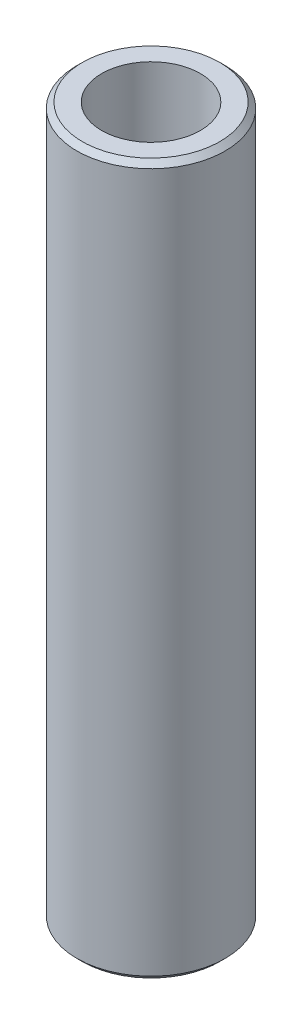
ISO-10303-21;
HEADER;
FILE_DESCRIPTION(('STEP AP214'),'2;1');
FILE_NAME('part.step','',(''),(''),'','','');
FILE_SCHEMA(('AUTOMOTIVE_DESIGN { 1 0 10303 214 1 1 1 1 }'));
ENDSEC;
DATA;
#1=APPLICATION_CONTEXT('core data for automotive mechanical design processes');
#2=APPLICATION_PROTOCOL_DEFINITION('international standard','automotive_design',2000,#1);
#3=PRODUCT_CONTEXT('',#1,'mechanical');
#4=PRODUCT('Part','Part','',(#3));
#5=PRODUCT_RELATED_PRODUCT_CATEGORY('part','',(#4));
#6=PRODUCT_DEFINITION_FORMATION('','',#4);
#7=PRODUCT_DEFINITION_CONTEXT('part definition',#1,'design');
#8=PRODUCT_DEFINITION('design','',#6,#7);
#9=PRODUCT_DEFINITION_SHAPE('','',#8);
#10=(LENGTH_UNIT() NAMED_UNIT(*) SI_UNIT(.MILLI.,.METRE.));
#11=(NAMED_UNIT(*) PLANE_ANGLE_UNIT() SI_UNIT($,.RADIAN.));
#12=(NAMED_UNIT(*) SI_UNIT($,.STERADIAN.) SOLID_ANGLE_UNIT());
#13=UNCERTAINTY_MEASURE_WITH_UNIT(LENGTH_MEASURE(1.E-05),#10,'distance_accuracy_value','');
#14=(GEOMETRIC_REPRESENTATION_CONTEXT(3) GLOBAL_UNCERTAINTY_ASSIGNED_CONTEXT((#13)) GLOBAL_UNIT_ASSIGNED_CONTEXT((#10,
#11,#12)) REPRESENTATION_CONTEXT('',''));
#15=CARTESIAN_POINT('',(0.,0.,0.));
#16=DIRECTION('',(0.,0.,1.));
#17=DIRECTION('',(1.,0.,0.));
#18=AXIS2_PLACEMENT_3D('',#15,#16,#17);
#19=CARTESIAN_POINT('',(0.,383.320295647991,0.));
#20=DIRECTION('',(0.,-1.,0.));
#21=DIRECTION('',(0.,0.,-1.));
#22=AXIS2_PLACEMENT_3D('',#19,#20,#21);
#23=CYLINDRICAL_SURFACE('',#22,40.);
#24=CARTESIAN_POINT('',(0.,380.403061199451,0.));
#25=DIRECTION('',(0.,1.,0.));
#26=DIRECTION('',(0.,0.,1.));
#27=AXIS2_PLACEMENT_3D('',#24,#25,#26);
#28=CIRCLE('',#27,40.);
#29=CARTESIAN_POINT('',(0.,380.403061199451,-40.));
#30=VERTEX_POINT('',#29);
#31=EDGE_CURVE('E50',#30,#30,#28,.F.);
#32=ORIENTED_EDGE('',*,*,#31,.T.);
#33=EDGE_LOOP('',(#32));
#34=FACE_BOUND('',#33,.T.);
#35=CARTESIAN_POINT('',(0.,2.9172344485402,0.));
#36=DIRECTION('',(0.,1.,0.));
#37=DIRECTION('',(0.,0.,1.));
#38=AXIS2_PLACEMENT_3D('',#35,#36,#37);
#39=CIRCLE('',#38,40.);
#40=CARTESIAN_POINT('',(0.,2.9172344485402,40.));
#41=VERTEX_POINT('',#40);
#42=EDGE_CURVE('E51',#41,#41,#39,.T.);
#43=ORIENTED_EDGE('',*,*,#42,.T.);
#44=EDGE_LOOP('',(#43));
#45=FACE_BOUND('',#44,.T.);
#46=ADVANCED_FACE('F39',(#34,#45),#23,.T.);
#47=CARTESIAN_POINT('',(0.,383.320295647991,0.));
#48=DIRECTION('',(0.,1.,0.));
#49=DIRECTION('',(0.,0.,1.));
#50=AXIS2_PLACEMENT_3D('',#47,#48,#49);
#51=PLANE('',#50);
#52=CARTESIAN_POINT('',(0.,383.320295647991,0.));
#53=DIRECTION('',(0.,1.,0.));
#54=DIRECTION('',(0.,0.,1.));
#55=AXIS2_PLACEMENT_3D('',#52,#53,#54);
#56=CIRCLE('',#55,37.0827655514597);
#57=CARTESIAN_POINT('',(0.,383.320295647991,-37.0827655514597));
#58=VERTEX_POINT('',#57);
#59=EDGE_CURVE('E54',#58,#58,#56,.T.);
#60=ORIENTED_EDGE('',*,*,#59,.T.);
#61=EDGE_LOOP('',(#60));
#62=FACE_BOUND('',#61,.T.);
#63=CARTESIAN_POINT('',(0.,383.320295647991,0.));
#64=DIRECTION('',(0.,1.,0.));
#65=DIRECTION('',(0.,0.,1.));
#66=AXIS2_PLACEMENT_3D('',#63,#64,#65);
#67=CIRCLE('',#66,26.6566328088334);
#68=CARTESIAN_POINT('',(0.,383.320295647991,26.6566328088334));
#69=VERTEX_POINT('',#68);
#70=EDGE_CURVE('E58',#69,#69,#67,.T.);
#71=ORIENTED_EDGE('',*,*,#70,.F.);
#72=EDGE_LOOP('',(#71));
#73=FACE_BOUND('',#72,.T.);
#74=ADVANCED_FACE('F69',(#62,#73),#51,.T.);
#75=CARTESIAN_POINT('',(0.,0.,0.));
#76=DIRECTION('',(0.,1.,0.));
#77=DIRECTION('',(0.,0.,1.));
#78=AXIS2_PLACEMENT_3D('',#75,#76,#77);
#79=PLANE('',#78);
#80=CARTESIAN_POINT('',(0.,0.,0.));
#81=DIRECTION('',(0.,1.,0.));
#82=DIRECTION('',(0.,0.,1.));
#83=AXIS2_PLACEMENT_3D('',#80,#81,#82);
#84=CIRCLE('',#83,37.0827655514598);
#85=CARTESIAN_POINT('',(0.,0.,37.0827655514598));
#86=VERTEX_POINT('',#85);
#87=EDGE_CURVE('E10',#86,#86,#84,.F.);
#88=ORIENTED_EDGE('',*,*,#87,.T.);
#89=EDGE_LOOP('',(#88));
#90=FACE_BOUND('',#89,.T.);
#91=CARTESIAN_POINT('',(0.,0.,0.));
#92=DIRECTION('',(0.,1.,0.));
#93=DIRECTION('',(0.,0.,1.));
#94=AXIS2_PLACEMENT_3D('',#91,#92,#93);
#95=CIRCLE('',#94,26.6566328088334);
#96=CARTESIAN_POINT('',(0.,0.,26.6566328088334));
#97=VERTEX_POINT('',#96);
#98=EDGE_CURVE('E63',#97,#97,#95,.T.);
#99=ORIENTED_EDGE('',*,*,#98,.T.);
#100=EDGE_LOOP('',(#99));
#101=FACE_BOUND('',#100,.T.);
#102=ADVANCED_FACE('F75',(#90,#101),#79,.F.);
#103=CARTESIAN_POINT('',(0.,383.320295647991,0.));
#104=DIRECTION('',(0.,-1.,0.));
#105=DIRECTION('',(0.,0.,-1.));
#106=AXIS2_PLACEMENT_3D('',#103,#104,#105);
#107=CYLINDRICAL_SURFACE('',#106,26.6566328088334);
#108=ORIENTED_EDGE('',*,*,#70,.T.);
#109=EDGE_LOOP('',(#108));
#110=FACE_BOUND('',#109,.T.);
#111=ORIENTED_EDGE('',*,*,#98,.F.);
#112=EDGE_LOOP('',(#111));
#113=FACE_BOUND('',#112,.T.);
#114=ADVANCED_FACE('F70',(#110,#113),#107,.F.);
#115=CARTESIAN_POINT('',(0.,383.320295647991,0.));
#116=DIRECTION('',(0.,-1.,0.));
#117=DIRECTION('',(0.,0.,-1.));
#118=AXIS2_PLACEMENT_3D('',#115,#116,#117);
#119=CONICAL_SURFACE('',#118,37.0827655514597,0.785398163397442);
#120=CARTESIAN_POINT('',(0.,380.403061199451,-40.));
#121=CARTESIAN_POINT('',(0.,380.43344905829,-39.9696121411611));
#122=CARTESIAN_POINT('',(0.,380.463836917129,-39.9392242823221));
#123=CARTESIAN_POINT('',(0.,380.524612634807,-39.8784485646442));
#124=CARTESIAN_POINT('',(0.,380.555000493646,-39.8480607058052));
#125=CARTESIAN_POINT('',(0.,380.615776211323,-39.7872849881273));
#126=CARTESIAN_POINT('',(0.,380.646164070162,-39.7568971292883));
#127=CARTESIAN_POINT('',(0.,380.70693978784,-39.6961214116104));
#128=CARTESIAN_POINT('',(0.,380.737327646679,-39.6657335527714));
#129=CARTESIAN_POINT('',(0.,380.798103364357,-39.6049578350935));
#130=CARTESIAN_POINT('',(0.,380.828491223196,-39.5745699762546));
#131=CARTESIAN_POINT('',(0.,380.889266940874,-39.5137942585766));
#132=CARTESIAN_POINT('',(0.,380.919654799713,-39.4834063997377));
#133=CARTESIAN_POINT('',(0.,380.980430517391,-39.4226306820598));
#134=CARTESIAN_POINT('',(0.,381.01081837623,-39.3922428232208));
#135=CARTESIAN_POINT('',(0.,381.071594093908,-39.3314671055429));
#136=CARTESIAN_POINT('',(0.,381.101981952747,-39.3010792467039));
#137=CARTESIAN_POINT('',(0.,381.162757670425,-39.240303529026));
#138=CARTESIAN_POINT('',(0.,381.193145529264,-39.209915670187));
#139=CARTESIAN_POINT('',(0.,381.253921246942,-39.1491399525091));
#140=CARTESIAN_POINT('',(0.,381.284309105781,-39.1187520936701));
#141=CARTESIAN_POINT('',(0.,381.345084823459,-39.0579763759922));
#142=CARTESIAN_POINT('',(0.,381.375472682298,-39.0275885171533));
#143=CARTESIAN_POINT('',(0.,381.436248399975,-38.9668127994753));
#144=CARTESIAN_POINT('',(0.,381.466636258814,-38.9364249406364));
#145=CARTESIAN_POINT('',(0.,381.527411976492,-38.8756492229585));
#146=CARTESIAN_POINT('',(0.,381.557799835331,-38.8452613641195));
#147=CARTESIAN_POINT('',(0.,381.618575553009,-38.7844856464416));
#148=CARTESIAN_POINT('',(0.,381.648963411848,-38.7540977876026));
#149=CARTESIAN_POINT('',(0.,381.709739129526,-38.6933220699247));
#150=CARTESIAN_POINT('',(0.,381.740126988365,-38.6629342110857));
#151=CARTESIAN_POINT('',(0.,381.800902706043,-38.6021584934078));
#152=CARTESIAN_POINT('',(0.,381.831290564882,-38.5717706345688));
#153=CARTESIAN_POINT('',(0.,381.89206628256,-38.5109949168909));
#154=CARTESIAN_POINT('',(0.,381.922454141399,-38.4806070580519));
#155=CARTESIAN_POINT('',(0.,381.983229859077,-38.419831340374));
#156=CARTESIAN_POINT('',(0.,382.013617717916,-38.3894434815351));
#157=CARTESIAN_POINT('',(0.,382.074393435594,-38.3286677638571));
#158=CARTESIAN_POINT('',(0.,382.104781294433,-38.2982799050182));
#159=CARTESIAN_POINT('',(0.,382.165557012111,-38.2375041873402));
#160=CARTESIAN_POINT('',(0.,382.195944870949,-38.2071163285013));
#161=CARTESIAN_POINT('',(0.,382.256720588627,-38.1463406108234));
#162=CARTESIAN_POINT('',(0.,382.287108447466,-38.1159527519844));
#163=CARTESIAN_POINT('',(0.,382.347884165144,-38.0551770343065));
#164=CARTESIAN_POINT('',(0.,382.378272023983,-38.0247891754675));
#165=CARTESIAN_POINT('',(0.,382.439047741661,-37.9640134577896));
#166=CARTESIAN_POINT('',(0.,382.4694356005,-37.9336255989506));
#167=CARTESIAN_POINT('',(0.,382.530211318178,-37.8728498812727));
#168=CARTESIAN_POINT('',(0.,382.560599177017,-37.8424620224337));
#169=CARTESIAN_POINT('',(0.,382.621374894695,-37.7816863047558));
#170=CARTESIAN_POINT('',(0.,382.651762753534,-37.7512984459169));
#171=CARTESIAN_POINT('',(0.,382.712538471212,-37.6905227282389));
#172=CARTESIAN_POINT('',(0.,382.742926330051,-37.6601348694));
#173=CARTESIAN_POINT('',(0.,382.803702047729,-37.599359151722));
#174=CARTESIAN_POINT('',(0.,382.834089906568,-37.5689712928831));
#175=CARTESIAN_POINT('',(0.,382.894865624246,-37.5081955752052));
#176=CARTESIAN_POINT('',(0.,382.925253483085,-37.4778077163662));
#177=CARTESIAN_POINT('',(0.,382.986029200763,-37.4170319986883));
#178=CARTESIAN_POINT('',(0.,383.016417059602,-37.3866441398493));
#179=CARTESIAN_POINT('',(0.,383.077192777279,-37.3258684221714));
#180=CARTESIAN_POINT('',(0.,383.107580636118,-37.2954805633324));
#181=CARTESIAN_POINT('',(0.,383.168356353796,-37.2347048456545));
#182=CARTESIAN_POINT('',(0.,383.198744212635,-37.2043169868155));
#183=CARTESIAN_POINT('',(0.,383.259519930313,-37.1435412691376));
#184=CARTESIAN_POINT('',(0.,383.289907789152,-37.1131534102987));
#185=CARTESIAN_POINT('',(0.,383.320295647991,-37.0827655514597));
#186=B_SPLINE_CURVE_WITH_KNOTS('',3,(#120,#121,#122,#123,#124,#125,#126,#127,#128,#129,#130,
#131,#132,#133,#134,#135,#136,#137,#138,#139,#140,#141,#142,#143,#144,#145,#146,#147,#148,#149,
#150,#151,#152,#153,#154,#155,#156,#157,#158,#159,#160,#161,#162,#163,#164,#165,#166,#167,#168,
#169,#170,#171,#172,#173,#174,#175,#176,#177,#178,#179,#180,#181,#182,#183,#184,#185),
.UNSPECIFIED.,.F.,.F.,(4,2,2,2,2,2,2,2,2,2,2,2,2,2,2,2,2,2,2,2,2,2,2,2,2,2,2,2,2,2,2,2,4),(0.,
0.12892476630462,0.257849532609246,0.386774298913871,0.515699065218492,0.644623831523117,
0.773548597827738,0.902473364132324,1.03139813043695,1.16032289674157,1.2892476630462,
1.41817242935082,1.54709719565544,1.67602196196003,1.80494672826465,1.93387149456927,
2.06279626087389,2.19172102717852,2.32064579348314,2.44957055978776,2.57849532609235,
2.70742009239697,2.8363448587016,2.96526962500622,3.09419439131084,3.22311915761547,
3.35204392392005,3.48096869022467,3.6098934565293,3.73881822283392,3.86774298913855,
3.99666775544317,4.12559252174779),.UNSPECIFIED.);
#187=EDGE_CURVE('BSEAM81',#30,#58,#186,.T.);
#188=ORIENTED_EDGE('',*,*,#31,.F.);
#189=ORIENTED_EDGE('',*,*,#59,.F.);
#190=ORIENTED_EDGE('',*,*,#187,.T.);
#191=ORIENTED_EDGE('',*,*,#187,.F.);
#192=EDGE_LOOP('',(#188,#190,#189,#191));
#193=FACE_BOUND('',#192,.T.);
#194=ADVANCED_FACE('F81',(#193),#119,.T.);
#195=CARTESIAN_POINT('',(0.,2.9172344485402,0.));
#196=DIRECTION('',(0.,1.,0.));
#197=DIRECTION('',(0.,0.,1.));
#198=AXIS2_PLACEMENT_3D('',#195,#196,#197);
#199=CONICAL_SURFACE('',#198,40.,0.785398163397457);
#200=ORIENTED_EDGE('',*,*,#87,.F.);
#201=EDGE_LOOP('',(#200));
#202=FACE_BOUND('',#201,.T.);
#203=ORIENTED_EDGE('',*,*,#42,.F.);
#204=EDGE_LOOP('',(#203));
#205=FACE_BOUND('',#204,.T.);
#206=ADVANCED_FACE('F45',(#202,#205),#199,.T.);
#207=CLOSED_SHELL('',(#46,#74,#102,#114,#194,#206));
#208=MANIFOLD_SOLID_BREP('B2',#207);
#209=ADVANCED_BREP_SHAPE_REPRESENTATION('',(#18,#208),#14);
#210=SHAPE_DEFINITION_REPRESENTATION(#9,#209);
ENDSEC;
END-ISO-10303-21;
